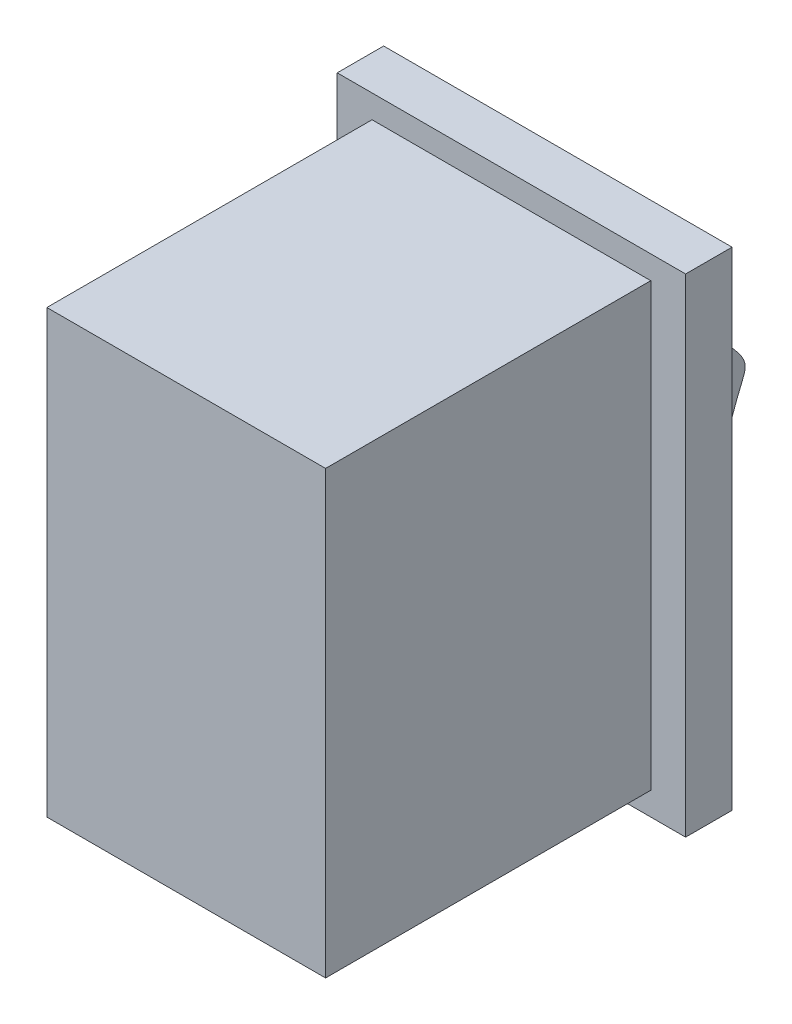
ISO-10303-21;
HEADER;
FILE_DESCRIPTION(('STEP AP214'),'2;1');
FILE_NAME('part.step','',(''),(''),'','','');
FILE_SCHEMA(('AUTOMOTIVE_DESIGN { 1 0 10303 214 1 1 1 1 }'));
ENDSEC;
DATA;
#1=APPLICATION_CONTEXT('core data for automotive mechanical design processes');
#2=APPLICATION_PROTOCOL_DEFINITION('international standard','automotive_design',2000,#1);
#3=PRODUCT_CONTEXT('',#1,'mechanical');
#4=PRODUCT('Part','Part','',(#3));
#5=PRODUCT_RELATED_PRODUCT_CATEGORY('part','',(#4));
#6=PRODUCT_DEFINITION_FORMATION('','',#4);
#7=PRODUCT_DEFINITION_CONTEXT('part definition',#1,'design');
#8=PRODUCT_DEFINITION('design','',#6,#7);
#9=PRODUCT_DEFINITION_SHAPE('','',#8);
#10=(LENGTH_UNIT() NAMED_UNIT(*) SI_UNIT(.MILLI.,.METRE.));
#11=(NAMED_UNIT(*) PLANE_ANGLE_UNIT() SI_UNIT($,.RADIAN.));
#12=(NAMED_UNIT(*) SI_UNIT($,.STERADIAN.) SOLID_ANGLE_UNIT());
#13=UNCERTAINTY_MEASURE_WITH_UNIT(LENGTH_MEASURE(1.E-05),#10,'distance_accuracy_value','');
#14=(GEOMETRIC_REPRESENTATION_CONTEXT(3) GLOBAL_UNCERTAINTY_ASSIGNED_CONTEXT((#13)) GLOBAL_UNIT_ASSIGNED_CONTEXT((#10,
#11,#12)) REPRESENTATION_CONTEXT('',''));
#15=CARTESIAN_POINT('',(0.,0.,0.));
#16=DIRECTION('',(0.,0.,1.));
#17=DIRECTION('',(1.,0.,0.));
#18=AXIS2_PLACEMENT_3D('',#15,#16,#17);
#19=CARTESIAN_POINT('',(0.,0.,14.));
#20=DIRECTION('',(1.,0.,0.));
#21=DIRECTION('',(0.,0.,-1.));
#22=AXIS2_PLACEMENT_3D('',#19,#20,#21);
#23=PLANE('',#22);
#24=DIRECTION('',(0.,-1.,0.));
#25=VECTOR('',#24,1.);
#26=CARTESIAN_POINT('',(0.,0.,0.));
#27=LINE('',#26,#25);
#28=CARTESIAN_POINT('',(0.,19.,0.));
#29=VERTEX_POINT('',#28);
#30=CARTESIAN_POINT('',(0.,0.,0.));
#31=VERTEX_POINT('',#30);
#32=EDGE_CURVE('E160',#29,#31,#27,.T.);
#33=ORIENTED_EDGE('',*,*,#32,.T.);
#34=DIRECTION('',(0.,0.,-1.));
#35=VECTOR('',#34,1.);
#36=CARTESIAN_POINT('',(0.,0.,14.));
#37=LINE('',#36,#35);
#38=CARTESIAN_POINT('',(0.,0.,14.));
#39=VERTEX_POINT('',#38);
#40=EDGE_CURVE('E11',#39,#31,#37,.T.);
#41=ORIENTED_EDGE('',*,*,#40,.F.);
#42=DIRECTION('',(0.,-1.,0.));
#43=VECTOR('',#42,1.);
#44=CARTESIAN_POINT('',(0.,0.,14.));
#45=LINE('',#44,#43);
#46=CARTESIAN_POINT('',(0.,19.,14.));
#47=VERTEX_POINT('',#46);
#48=EDGE_CURVE('E166',#47,#39,#45,.T.);
#49=ORIENTED_EDGE('',*,*,#48,.F.);
#50=DIRECTION('',(0.,0.,-1.));
#51=VECTOR('',#50,1.);
#52=CARTESIAN_POINT('',(0.,19.,14.));
#53=LINE('',#52,#51);
#54=EDGE_CURVE('E176',#47,#29,#53,.T.);
#55=ORIENTED_EDGE('',*,*,#54,.T.);
#56=EDGE_LOOP('',(#33,#41,#49,#55));
#57=FACE_BOUND('',#56,.T.);
#58=ADVANCED_FACE('F35',(#57),#23,.F.);
#59=CARTESIAN_POINT('',(0.,0.,14.));
#60=DIRECTION('',(0.,1.,0.));
#61=DIRECTION('',(0.,0.,1.));
#62=AXIS2_PLACEMENT_3D('',#59,#60,#61);
#63=PLANE('',#62);
#64=DIRECTION('',(1.,0.,0.));
#65=VECTOR('',#64,1.);
#66=CARTESIAN_POINT('',(0.,0.,0.));
#67=LINE('',#66,#65);
#68=CARTESIAN_POINT('',(12.,0.,0.));
#69=VERTEX_POINT('',#68);
#70=EDGE_CURVE('E179',#31,#69,#67,.T.);
#71=ORIENTED_EDGE('',*,*,#70,.T.);
#72=DIRECTION('',(0.,0.,-1.));
#73=VECTOR('',#72,1.);
#74=CARTESIAN_POINT('',(12.,0.,14.));
#75=LINE('',#74,#73);
#76=CARTESIAN_POINT('',(12.,0.,14.));
#77=VERTEX_POINT('',#76);
#78=EDGE_CURVE('E42',#77,#69,#75,.T.);
#79=ORIENTED_EDGE('',*,*,#78,.F.);
#80=DIRECTION('',(1.,0.,0.));
#81=VECTOR('',#80,1.);
#82=CARTESIAN_POINT('',(0.,0.,14.));
#83=LINE('',#82,#81);
#84=EDGE_CURVE('E169',#39,#77,#83,.T.);
#85=ORIENTED_EDGE('',*,*,#84,.F.);
#86=ORIENTED_EDGE('',*,*,#40,.T.);
#87=EDGE_LOOP('',(#71,#79,#85,#86));
#88=FACE_BOUND('',#87,.T.);
#89=ADVANCED_FACE('F198',(#88),#63,.F.);
#90=CARTESIAN_POINT('',(12.,0.,14.));
#91=DIRECTION('',(-1.,0.,0.));
#92=DIRECTION('',(0.,0.,1.));
#93=AXIS2_PLACEMENT_3D('',#90,#91,#92);
#94=PLANE('',#93);
#95=DIRECTION('',(0.,1.,0.));
#96=VECTOR('',#95,1.);
#97=CARTESIAN_POINT('',(12.,0.,0.));
#98=LINE('',#97,#96);
#99=CARTESIAN_POINT('',(12.,19.,0.));
#100=VERTEX_POINT('',#99);
#101=EDGE_CURVE('E182',#69,#100,#98,.T.);
#102=ORIENTED_EDGE('',*,*,#101,.T.);
#103=DIRECTION('',(0.,0.,-1.));
#104=VECTOR('',#103,1.);
#105=CARTESIAN_POINT('',(12.,19.,14.));
#106=LINE('',#105,#104);
#107=CARTESIAN_POINT('',(12.,19.,14.));
#108=VERTEX_POINT('',#107);
#109=EDGE_CURVE('E189',#108,#100,#106,.T.);
#110=ORIENTED_EDGE('',*,*,#109,.F.);
#111=DIRECTION('',(0.,1.,0.));
#112=VECTOR('',#111,1.);
#113=CARTESIAN_POINT('',(12.,0.,14.));
#114=LINE('',#113,#112);
#115=EDGE_CURVE('E172',#77,#108,#114,.T.);
#116=ORIENTED_EDGE('',*,*,#115,.F.);
#117=ORIENTED_EDGE('',*,*,#78,.T.);
#118=EDGE_LOOP('',(#102,#110,#116,#117));
#119=FACE_BOUND('',#118,.T.);
#120=ADVANCED_FACE('F195',(#119),#94,.F.);
#121=CARTESIAN_POINT('',(0.,19.,14.));
#122=DIRECTION('',(0.,-1.,0.));
#123=DIRECTION('',(0.,0.,-1.));
#124=AXIS2_PLACEMENT_3D('',#121,#122,#123);
#125=PLANE('',#124);
#126=DIRECTION('',(-1.,0.,0.));
#127=VECTOR('',#126,1.);
#128=CARTESIAN_POINT('',(0.,19.,0.));
#129=LINE('',#128,#127);
#130=EDGE_CURVE('E170',#100,#29,#129,.T.);
#131=ORIENTED_EDGE('',*,*,#130,.T.);
#132=ORIENTED_EDGE('',*,*,#54,.F.);
#133=DIRECTION('',(-1.,0.,0.));
#134=VECTOR('',#133,1.);
#135=CARTESIAN_POINT('',(0.,19.,14.));
#136=LINE('',#135,#134);
#137=EDGE_CURVE('E174',#108,#47,#136,.T.);
#138=ORIENTED_EDGE('',*,*,#137,.F.);
#139=ORIENTED_EDGE('',*,*,#109,.T.);
#140=EDGE_LOOP('',(#131,#132,#138,#139));
#141=FACE_BOUND('',#140,.T.);
#142=ADVANCED_FACE('F204',(#141),#125,.F.);
#143=CARTESIAN_POINT('',(0.,0.,14.));
#144=DIRECTION('',(0.,0.,-1.));
#145=DIRECTION('',(-1.,0.,0.));
#146=AXIS2_PLACEMENT_3D('',#143,#144,#145);
#147=PLANE('',#146);
#148=ORIENTED_EDGE('',*,*,#48,.T.);
#149=ORIENTED_EDGE('',*,*,#84,.T.);
#150=ORIENTED_EDGE('',*,*,#115,.T.);
#151=ORIENTED_EDGE('',*,*,#137,.T.);
#152=EDGE_LOOP('',(#148,#149,#150,#151));
#153=FACE_BOUND('',#152,.T.);
#154=ADVANCED_FACE('F209',(#153),#147,.F.);
#155=CARTESIAN_POINT('',(0.,0.,0.));
#156=DIRECTION('',(0.,0.,1.));
#157=DIRECTION('',(1.,0.,0.));
#158=AXIS2_PLACEMENT_3D('',#155,#156,#157);
#159=PLANE('',#158);
#160=DIRECTION('',(0.,1.,0.));
#161=VECTOR('',#160,1.);
#162=CARTESIAN_POINT('',(13.5,20.,0.));
#163=LINE('',#162,#161);
#164=CARTESIAN_POINT('',(13.5,-1.,0.));
#165=VERTEX_POINT('',#164);
#166=CARTESIAN_POINT('',(13.5,20.,0.));
#167=VERTEX_POINT('',#166);
#168=EDGE_CURVE('E115',#165,#167,#163,.T.);
#169=ORIENTED_EDGE('',*,*,#168,.T.);
#170=DIRECTION('',(-1.,0.,0.));
#171=VECTOR('',#170,1.);
#172=CARTESIAN_POINT('',(-1.5,20.,0.));
#173=LINE('',#172,#171);
#174=CARTESIAN_POINT('',(-1.5,20.,0.));
#175=VERTEX_POINT('',#174);
#176=EDGE_CURVE('E150',#167,#175,#173,.T.);
#177=ORIENTED_EDGE('',*,*,#176,.T.);
#178=DIRECTION('',(0.,-1.,0.));
#179=VECTOR('',#178,1.);
#180=CARTESIAN_POINT('',(-1.5,20.,0.));
#181=LINE('',#180,#179);
#182=CARTESIAN_POINT('',(-1.5,-1.,0.));
#183=VERTEX_POINT('',#182);
#184=EDGE_CURVE('E153',#175,#183,#181,.T.);
#185=ORIENTED_EDGE('',*,*,#184,.T.);
#186=DIRECTION('',(1.,0.,0.));
#187=VECTOR('',#186,1.);
#188=CARTESIAN_POINT('',(-1.5,-1.,0.));
#189=LINE('',#188,#187);
#190=EDGE_CURVE('E138',#183,#165,#189,.T.);
#191=ORIENTED_EDGE('',*,*,#190,.T.);
#192=EDGE_LOOP('',(#169,#177,#185,#191));
#193=FACE_BOUND('',#192,.T.);
#194=ORIENTED_EDGE('',*,*,#32,.F.);
#195=ORIENTED_EDGE('',*,*,#130,.F.);
#196=ORIENTED_EDGE('',*,*,#101,.F.);
#197=ORIENTED_EDGE('',*,*,#70,.F.);
#198=EDGE_LOOP('',(#194,#195,#196,#197));
#199=FACE_BOUND('',#198,.T.);
#200=ADVANCED_FACE('F201',(#193,#199),#159,.T.);
#201=CARTESIAN_POINT('',(13.5,20.,-2.));
#202=DIRECTION('',(1.,0.,0.));
#203=DIRECTION('',(0.,1.,0.));
#204=AXIS2_PLACEMENT_3D('',#201,#202,#203);
#205=PLANE('',#204);
#206=ORIENTED_EDGE('',*,*,#168,.F.);
#207=DIRECTION('',(0.,0.,1.));
#208=VECTOR('',#207,1.);
#209=CARTESIAN_POINT('',(13.5,-1.,-2.));
#210=LINE('',#209,#208);
#211=CARTESIAN_POINT('',(13.5,-1.,-2.));
#212=VERTEX_POINT('',#211);
#213=EDGE_CURVE('E158',#212,#165,#210,.T.);
#214=ORIENTED_EDGE('',*,*,#213,.F.);
#215=DIRECTION('',(0.,1.,0.));
#216=VECTOR('',#215,1.);
#217=CARTESIAN_POINT('',(13.5,20.,-2.));
#218=LINE('',#217,#216);
#219=CARTESIAN_POINT('',(13.5,20.,-2.));
#220=VERTEX_POINT('',#219);
#221=EDGE_CURVE('E134',#212,#220,#218,.T.);
#222=ORIENTED_EDGE('',*,*,#221,.T.);
#223=DIRECTION('',(0.,0.,1.));
#224=VECTOR('',#223,1.);
#225=CARTESIAN_POINT('',(13.5,20.,-2.));
#226=LINE('',#225,#224);
#227=EDGE_CURVE('E147',#220,#167,#226,.T.);
#228=ORIENTED_EDGE('',*,*,#227,.T.);
#229=EDGE_LOOP('',(#206,#214,#222,#228));
#230=FACE_BOUND('',#229,.T.);
#231=ADVANCED_FACE('F216',(#230),#205,.T.);
#232=CARTESIAN_POINT('',(-1.5,-1.,-2.));
#233=DIRECTION('',(0.,-1.,0.));
#234=DIRECTION('',(1.,0.,0.));
#235=AXIS2_PLACEMENT_3D('',#232,#233,#234);
#236=PLANE('',#235);
#237=ORIENTED_EDGE('',*,*,#190,.F.);
#238=DIRECTION('',(0.,0.,1.));
#239=VECTOR('',#238,1.);
#240=CARTESIAN_POINT('',(-1.5,-1.,-2.));
#241=LINE('',#240,#239);
#242=CARTESIAN_POINT('',(-1.5,-1.,-2.));
#243=VERTEX_POINT('',#242);
#244=EDGE_CURVE('E161',#243,#183,#241,.T.);
#245=ORIENTED_EDGE('',*,*,#244,.F.);
#246=DIRECTION('',(1.,0.,0.));
#247=VECTOR('',#246,1.);
#248=CARTESIAN_POINT('',(-1.5,-1.,-2.));
#249=LINE('',#248,#247);
#250=EDGE_CURVE('E144',#243,#212,#249,.T.);
#251=ORIENTED_EDGE('',*,*,#250,.T.);
#252=ORIENTED_EDGE('',*,*,#213,.T.);
#253=EDGE_LOOP('',(#237,#245,#251,#252));
#254=FACE_BOUND('',#253,.T.);
#255=ADVANCED_FACE('F255',(#254),#236,.T.);
#256=CARTESIAN_POINT('',(-1.5,20.,-2.));
#257=DIRECTION('',(-1.,0.,0.));
#258=DIRECTION('',(0.,-1.,0.));
#259=AXIS2_PLACEMENT_3D('',#256,#257,#258);
#260=PLANE('',#259);
#261=ORIENTED_EDGE('',*,*,#184,.F.);
#262=DIRECTION('',(0.,0.,1.));
#263=VECTOR('',#262,1.);
#264=CARTESIAN_POINT('',(-1.5,20.,-2.));
#265=LINE('',#264,#263);
#266=CARTESIAN_POINT('',(-1.5,20.,-2.));
#267=VERTEX_POINT('',#266);
#268=EDGE_CURVE('E163',#267,#175,#265,.T.);
#269=ORIENTED_EDGE('',*,*,#268,.F.);
#270=DIRECTION('',(0.,-1.,0.));
#271=VECTOR('',#270,1.);
#272=CARTESIAN_POINT('',(-1.5,20.,-2.));
#273=LINE('',#272,#271);
#274=EDGE_CURVE('E141',#267,#243,#273,.T.);
#275=ORIENTED_EDGE('',*,*,#274,.T.);
#276=ORIENTED_EDGE('',*,*,#244,.T.);
#277=EDGE_LOOP('',(#261,#269,#275,#276));
#278=FACE_BOUND('',#277,.T.);
#279=ADVANCED_FACE('F264',(#278),#260,.T.);
#280=CARTESIAN_POINT('',(-1.5,20.,-2.));
#281=DIRECTION('',(0.,1.,0.));
#282=DIRECTION('',(0.,0.,1.));
#283=AXIS2_PLACEMENT_3D('',#280,#281,#282);
#284=PLANE('',#283);
#285=ORIENTED_EDGE('',*,*,#176,.F.);
#286=ORIENTED_EDGE('',*,*,#227,.F.);
#287=DIRECTION('',(-1.,0.,0.));
#288=VECTOR('',#287,1.);
#289=CARTESIAN_POINT('',(-1.5,20.,-2.));
#290=LINE('',#289,#288);
#291=EDGE_CURVE('E137',#220,#267,#290,.T.);
#292=ORIENTED_EDGE('',*,*,#291,.T.);
#293=ORIENTED_EDGE('',*,*,#268,.T.);
#294=EDGE_LOOP('',(#285,#286,#292,#293));
#295=FACE_BOUND('',#294,.T.);
#296=ADVANCED_FACE('F274',(#295),#284,.T.);
#297=CARTESIAN_POINT('',(0.,0.,-2.));
#298=DIRECTION('',(0.,0.,1.));
#299=DIRECTION('',(1.,0.,0.));
#300=AXIS2_PLACEMENT_3D('',#297,#298,#299);
#301=PLANE('',#300);
#302=DIRECTION('',(-1.,0.,0.));
#303=VECTOR('',#302,1.);
#304=CARTESIAN_POINT('',(11.,2.5,-2.));
#305=LINE('',#304,#303);
#306=CARTESIAN_POINT('',(11.,2.5,-2.));
#307=VERTEX_POINT('',#306);
#308=CARTESIAN_POINT('',(1.,2.5,-2.));
#309=VERTEX_POINT('',#308);
#310=EDGE_CURVE('E49',#307,#309,#305,.T.);
#311=ORIENTED_EDGE('',*,*,#310,.F.);
#312=DIRECTION('',(0.,-1.,0.));
#313=VECTOR('',#312,1.);
#314=CARTESIAN_POINT('',(11.,16.5,-2.));
#315=LINE('',#314,#313);
#316=CARTESIAN_POINT('',(11.,16.5,-2.));
#317=VERTEX_POINT('',#316);
#318=EDGE_CURVE('E53',#317,#307,#315,.T.);
#319=ORIENTED_EDGE('',*,*,#318,.F.);
#320=DIRECTION('',(-1.,0.,0.));
#321=VECTOR('',#320,1.);
#322=CARTESIAN_POINT('',(11.,16.5,-2.));
#323=LINE('',#322,#321);
#324=CARTESIAN_POINT('',(1.,16.5,-2.));
#325=VERTEX_POINT('',#324);
#326=EDGE_CURVE('E107',#317,#325,#323,.T.);
#327=ORIENTED_EDGE('',*,*,#326,.T.);
#328=DIRECTION('',(0.,-1.,0.));
#329=VECTOR('',#328,1.);
#330=CARTESIAN_POINT('',(1.,16.5,-2.));
#331=LINE('',#330,#329);
#332=EDGE_CURVE('E111',#325,#309,#331,.T.);
#333=ORIENTED_EDGE('',*,*,#332,.T.);
#334=EDGE_LOOP('',(#311,#319,#327,#333));
#335=FACE_BOUND('',#334,.T.);
#336=ORIENTED_EDGE('',*,*,#221,.F.);
#337=ORIENTED_EDGE('',*,*,#250,.F.);
#338=ORIENTED_EDGE('',*,*,#274,.F.);
#339=ORIENTED_EDGE('',*,*,#291,.F.);
#340=EDGE_LOOP('',(#336,#337,#338,#339));
#341=FACE_BOUND('',#340,.T.);
#342=ADVANCED_FACE('F109',(#335,#341),#301,.F.);
#343=CARTESIAN_POINT('',(11.,2.5,-2.));
#344=CARTESIAN_POINT('',(11.,3.41214672085486,-2.));
#345=CARTESIAN_POINT('',(11.,14.1136674235115,-5.21868628597108));
#346=CARTESIAN_POINT('',(11.,12.6812955380571,-5.40139394787936));
#347=CARTESIAN_POINT('',(11.,16.5,-2.));
#348=B_SPLINE_CURVE_WITH_KNOTS('',3,(#343,#344,#345,#346,#347),.UNSPECIFIED.,.F.,.F.,(4,1,4),
(0.,0.602336798593028,1.),.UNSPECIFIED.);
#349=DIRECTION('',(-1.,0.,0.));
#350=VECTOR('',#349,1.);
#351=SURFACE_OF_LINEAR_EXTRUSION('',#348,#350);
#352=CARTESIAN_POINT('',(1.,2.5,-2.));
#353=CARTESIAN_POINT('',(1.,3.41214672085486,-2.));
#354=CARTESIAN_POINT('',(1.,14.1136674235115,-5.21868628597108));
#355=CARTESIAN_POINT('',(1.,12.6812955380571,-5.40139394787936));
#356=CARTESIAN_POINT('',(1.,16.5,-2.));
#357=B_SPLINE_CURVE_WITH_KNOTS('',3,(#352,#353,#354,#355,#356),.UNSPECIFIED.,.F.,.F.,(4,1,4),
(0.,0.602336798593028,1.),.UNSPECIFIED.);
#358=EDGE_CURVE('E120',#309,#325,#357,.T.);
#359=ORIENTED_EDGE('',*,*,#358,.T.);
#360=ORIENTED_EDGE('',*,*,#326,.F.);
#361=EDGE_CURVE('E121',#307,#317,#348,.T.);
#362=ORIENTED_EDGE('',*,*,#361,.F.);
#363=ORIENTED_EDGE('',*,*,#310,.T.);
#364=EDGE_LOOP('',(#359,#360,#362,#363));
#365=FACE_BOUND('',#364,.T.);
#366=ADVANCED_FACE('F123',(#365),#351,.F.);
#367=CARTESIAN_POINT('',(11.,10.5275601691982,-4.2687626251712));
#368=DIRECTION('',(1.,0.,0.));
#369=DIRECTION('',(0.,0.,-1.));
#370=AXIS2_PLACEMENT_3D('',#367,#368,#369);
#371=PLANE('',#370);
#372=ORIENTED_EDGE('',*,*,#361,.T.);
#373=ORIENTED_EDGE('',*,*,#318,.T.);
#374=EDGE_LOOP('',(#372,#373));
#375=FACE_BOUND('',#374,.T.);
#376=ADVANCED_FACE('F301',(#375),#371,.T.);
#377=CARTESIAN_POINT('',(1.,10.5275601691982,-4.2687626251712));
#378=DIRECTION('',(1.,0.,0.));
#379=DIRECTION('',(0.,0.,-1.));
#380=AXIS2_PLACEMENT_3D('',#377,#378,#379);
#381=PLANE('',#380);
#382=ORIENTED_EDGE('',*,*,#358,.F.);
#383=ORIENTED_EDGE('',*,*,#332,.F.);
#384=EDGE_LOOP('',(#382,#383));
#385=FACE_BOUND('',#384,.T.);
#386=ADVANCED_FACE('F119',(#385),#381,.F.);
#387=CLOSED_SHELL('',(#58,#89,#120,#142,#154,#200,#231,#255,#279,#296,#342,#366,#376,#386));
#388=MANIFOLD_SOLID_BREP('B2',#387);
#389=ADVANCED_BREP_SHAPE_REPRESENTATION('',(#18,#388),#14);
#390=SHAPE_DEFINITION_REPRESENTATION(#9,#389);
ENDSEC;
END-ISO-10303-21;
